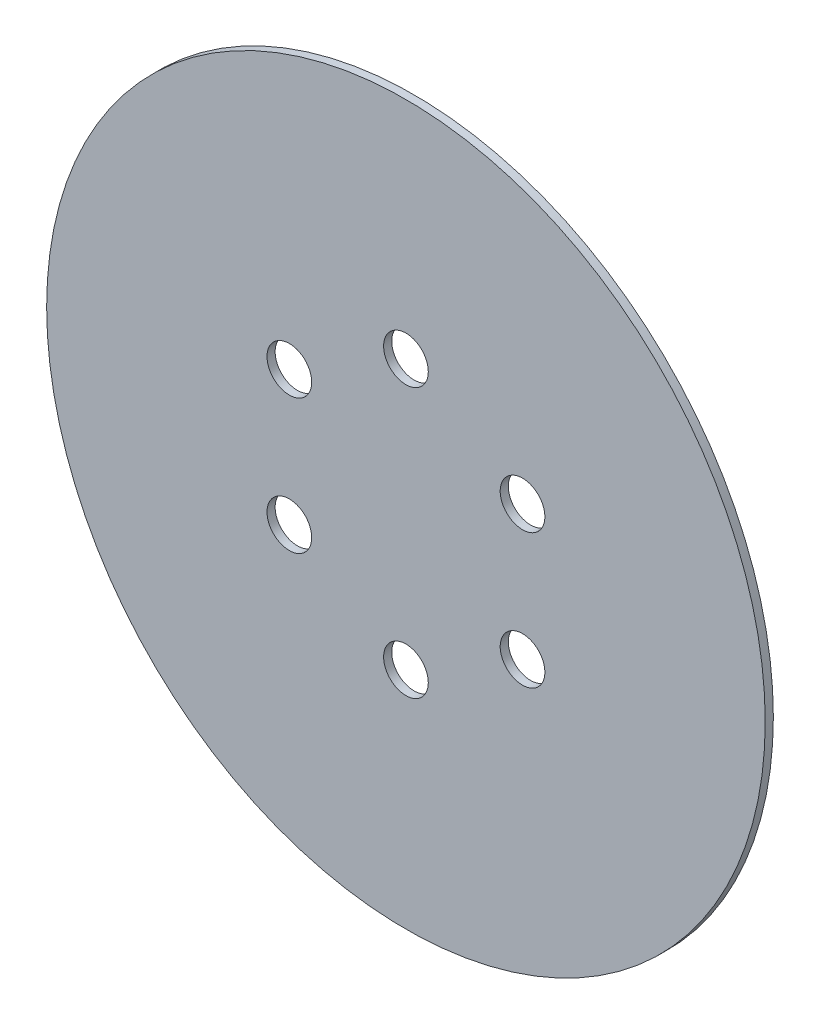
ISO-10303-21;
HEADER;
FILE_DESCRIPTION(('STEP AP214'),'2;1');
FILE_NAME('part.step','',(''),(''),'','','');
FILE_SCHEMA(('AUTOMOTIVE_DESIGN { 1 0 10303 214 1 1 1 1 }'));
ENDSEC;
DATA;
#1=APPLICATION_CONTEXT('core data for automotive mechanical design processes');
#2=APPLICATION_PROTOCOL_DEFINITION('international standard','automotive_design',2000,#1);
#3=PRODUCT_CONTEXT('',#1,'mechanical');
#4=PRODUCT('Part','Part','',(#3));
#5=PRODUCT_RELATED_PRODUCT_CATEGORY('part','',(#4));
#6=PRODUCT_DEFINITION_FORMATION('','',#4);
#7=PRODUCT_DEFINITION_CONTEXT('part definition',#1,'design');
#8=PRODUCT_DEFINITION('design','',#6,#7);
#9=PRODUCT_DEFINITION_SHAPE('','',#8);
#10=(LENGTH_UNIT() NAMED_UNIT(*) SI_UNIT(.MILLI.,.METRE.));
#11=(NAMED_UNIT(*) PLANE_ANGLE_UNIT() SI_UNIT($,.RADIAN.));
#12=(NAMED_UNIT(*) SI_UNIT($,.STERADIAN.) SOLID_ANGLE_UNIT());
#13=UNCERTAINTY_MEASURE_WITH_UNIT(LENGTH_MEASURE(1.E-05),#10,'distance_accuracy_value','');
#14=(GEOMETRIC_REPRESENTATION_CONTEXT(3) GLOBAL_UNCERTAINTY_ASSIGNED_CONTEXT((#13)) GLOBAL_UNIT_ASSIGNED_CONTEXT((#10,
#11,#12)) REPRESENTATION_CONTEXT('',''));
#15=CARTESIAN_POINT('',(0.,0.,0.));
#16=DIRECTION('',(0.,0.,1.));
#17=DIRECTION('',(1.,0.,0.));
#18=AXIS2_PLACEMENT_3D('',#15,#16,#17);
#19=CARTESIAN_POINT('',(0.,1.04933711243064,1.));
#20=DIRECTION('',(0.,0.,1.));
#21=DIRECTION('',(1.,0.,0.));
#22=AXIS2_PLACEMENT_3D('',#19,#20,#21);
#23=PLANE('',#22);
#24=CARTESIAN_POINT('',(-14.3500409407081,-7.23566288756953,1.));
#25=DIRECTION('',(0.,0.,1.));
#26=DIRECTION('',(1.,0.,0.));
#27=AXIS2_PLACEMENT_3D('',#24,#25,#26);
#28=CIRCLE('',#27,2.75);
#29=CARTESIAN_POINT('',(-11.6000409407081,-7.23566288756953,1.));
#30=VERTEX_POINT('',#29);
#31=EDGE_CURVE('E69',#30,#30,#28,.T.);
#32=ORIENTED_EDGE('',*,*,#31,.F.);
#33=EDGE_LOOP('',(#32));
#34=FACE_BOUND('',#33,.T.);
#35=CARTESIAN_POINT('',(14.3500409407082,-7.23566288756933,1.));
#36=DIRECTION('',(0.,0.,1.));
#37=DIRECTION('',(1.,0.,0.));
#38=AXIS2_PLACEMENT_3D('',#35,#36,#37);
#39=CIRCLE('',#38,2.75);
#40=CARTESIAN_POINT('',(17.1000409407082,-7.23566288756933,1.));
#41=VERTEX_POINT('',#40);
#42=EDGE_CURVE('E57',#41,#41,#39,.T.);
#43=ORIENTED_EDGE('',*,*,#42,.F.);
#44=EDGE_LOOP('',(#43));
#45=FACE_BOUND('',#44,.T.);
#46=CARTESIAN_POINT('',(-1.15964705036454E-13,17.6193371124306,1.));
#47=DIRECTION('',(0.,0.,1.));
#48=DIRECTION('',(1.,0.,0.));
#49=AXIS2_PLACEMENT_3D('',#46,#47,#48);
#50=CIRCLE('',#49,2.75);
#51=CARTESIAN_POINT('',(2.74999999999988,17.6193371124306,1.));
#52=VERTEX_POINT('',#51);
#53=EDGE_CURVE('E46',#52,#52,#50,.T.);
#54=ORIENTED_EDGE('',*,*,#53,.F.);
#55=EDGE_LOOP('',(#54));
#56=FACE_BOUND('',#55,.T.);
#57=CARTESIAN_POINT('',(0.,1.04933711243064,1.));
#58=DIRECTION('',(0.,0.,1.));
#59=DIRECTION('',(1.,0.,0.));
#60=AXIS2_PLACEMENT_3D('',#57,#58,#59);
#61=CIRCLE('',#60,44.22);
#62=CARTESIAN_POINT('',(44.22,1.04933711243064,1.));
#63=VERTEX_POINT('',#62);
#64=EDGE_CURVE('E10',#63,#63,#61,.T.);
#65=ORIENTED_EDGE('',*,*,#64,.T.);
#66=EDGE_LOOP('',(#65));
#67=FACE_BOUND('',#66,.T.);
#68=CARTESIAN_POINT('',(14.3500409407081,9.3343371124307,1.));
#69=DIRECTION('',(0.,0.,1.));
#70=DIRECTION('',(1.,0.,0.));
#71=AXIS2_PLACEMENT_3D('',#68,#69,#70);
#72=CIRCLE('',#71,2.75);
#73=CARTESIAN_POINT('',(17.1000409407081,9.3343371124307,1.));
#74=VERTEX_POINT('',#73);
#75=EDGE_CURVE('E51',#74,#74,#72,.T.);
#76=ORIENTED_EDGE('',*,*,#75,.F.);
#77=EDGE_LOOP('',(#76));
#78=FACE_BOUND('',#77,.T.);
#79=CARTESIAN_POINT('',(0.,-15.5206628875694,1.));
#80=DIRECTION('',(0.,0.,1.));
#81=DIRECTION('',(1.,0.,0.));
#82=AXIS2_PLACEMENT_3D('',#79,#80,#81);
#83=CIRCLE('',#82,2.75);
#84=CARTESIAN_POINT('',(2.75,-15.5206628875694,1.));
#85=VERTEX_POINT('',#84);
#86=EDGE_CURVE('E63',#85,#85,#83,.T.);
#87=ORIENTED_EDGE('',*,*,#86,.F.);
#88=EDGE_LOOP('',(#87));
#89=FACE_BOUND('',#88,.T.);
#90=CARTESIAN_POINT('',(-14.3500409407082,9.33433711243051,1.));
#91=DIRECTION('',(0.,0.,1.));
#92=DIRECTION('',(1.,0.,0.));
#93=AXIS2_PLACEMENT_3D('',#90,#91,#92);
#94=CIRCLE('',#93,2.75);
#95=CARTESIAN_POINT('',(-11.6000409407082,9.33433711243051,1.));
#96=VERTEX_POINT('',#95);
#97=EDGE_CURVE('E75',#96,#96,#94,.T.);
#98=ORIENTED_EDGE('',*,*,#97,.F.);
#99=EDGE_LOOP('',(#98));
#100=FACE_BOUND('',#99,.T.);
#101=ADVANCED_FACE('F35',(#34,#45,#56,#67,#78,#89,#100),#23,.T.);
#102=CARTESIAN_POINT('',(0.,1.04933711243064,0.));
#103=DIRECTION('',(0.,0.,1.));
#104=DIRECTION('',(1.,0.,0.));
#105=AXIS2_PLACEMENT_3D('',#102,#103,#104);
#106=PLANE('',#105);
#107=CARTESIAN_POINT('',(0.,1.04933711243064,0.));
#108=DIRECTION('',(0.,0.,1.));
#109=DIRECTION('',(1.,0.,0.));
#110=AXIS2_PLACEMENT_3D('',#107,#108,#109);
#111=CIRCLE('',#110,44.22);
#112=CARTESIAN_POINT('',(44.22,1.04933711243064,0.));
#113=VERTEX_POINT('',#112);
#114=EDGE_CURVE('E39',#113,#113,#111,.T.);
#115=ORIENTED_EDGE('',*,*,#114,.F.);
#116=EDGE_LOOP('',(#115));
#117=FACE_BOUND('',#116,.T.);
#118=CARTESIAN_POINT('',(-1.15964705036454E-13,17.6193371124306,0.));
#119=DIRECTION('',(0.,0.,1.));
#120=DIRECTION('',(1.,0.,0.));
#121=AXIS2_PLACEMENT_3D('',#118,#119,#120);
#122=CIRCLE('',#121,2.75);
#123=CARTESIAN_POINT('',(2.74999999999988,17.6193371124306,0.));
#124=VERTEX_POINT('',#123);
#125=EDGE_CURVE('E48',#124,#124,#122,.T.);
#126=ORIENTED_EDGE('',*,*,#125,.T.);
#127=EDGE_LOOP('',(#126));
#128=FACE_BOUND('',#127,.T.);
#129=CARTESIAN_POINT('',(14.3500409407081,9.3343371124307,0.));
#130=DIRECTION('',(0.,0.,1.));
#131=DIRECTION('',(1.,0.,0.));
#132=AXIS2_PLACEMENT_3D('',#129,#130,#131);
#133=CIRCLE('',#132,2.75);
#134=CARTESIAN_POINT('',(17.1000409407081,9.3343371124307,0.));
#135=VERTEX_POINT('',#134);
#136=EDGE_CURVE('E54',#135,#135,#133,.T.);
#137=ORIENTED_EDGE('',*,*,#136,.T.);
#138=EDGE_LOOP('',(#137));
#139=FACE_BOUND('',#138,.T.);
#140=CARTESIAN_POINT('',(14.3500409407082,-7.23566288756933,0.));
#141=DIRECTION('',(0.,0.,1.));
#142=DIRECTION('',(1.,0.,0.));
#143=AXIS2_PLACEMENT_3D('',#140,#141,#142);
#144=CIRCLE('',#143,2.75);
#145=CARTESIAN_POINT('',(17.1000409407082,-7.23566288756933,0.));
#146=VERTEX_POINT('',#145);
#147=EDGE_CURVE('E60',#146,#146,#144,.T.);
#148=ORIENTED_EDGE('',*,*,#147,.T.);
#149=EDGE_LOOP('',(#148));
#150=FACE_BOUND('',#149,.T.);
#151=CARTESIAN_POINT('',(0.,-15.5206628875694,0.));
#152=DIRECTION('',(0.,0.,1.));
#153=DIRECTION('',(1.,0.,0.));
#154=AXIS2_PLACEMENT_3D('',#151,#152,#153);
#155=CIRCLE('',#154,2.75);
#156=CARTESIAN_POINT('',(2.75,-15.5206628875694,0.));
#157=VERTEX_POINT('',#156);
#158=EDGE_CURVE('E66',#157,#157,#155,.T.);
#159=ORIENTED_EDGE('',*,*,#158,.T.);
#160=EDGE_LOOP('',(#159));
#161=FACE_BOUND('',#160,.T.);
#162=CARTESIAN_POINT('',(-14.3500409407081,-7.23566288756953,0.));
#163=DIRECTION('',(0.,0.,1.));
#164=DIRECTION('',(1.,0.,0.));
#165=AXIS2_PLACEMENT_3D('',#162,#163,#164);
#166=CIRCLE('',#165,2.75);
#167=CARTESIAN_POINT('',(-11.6000409407081,-7.23566288756953,0.));
#168=VERTEX_POINT('',#167);
#169=EDGE_CURVE('E72',#168,#168,#166,.T.);
#170=ORIENTED_EDGE('',*,*,#169,.T.);
#171=EDGE_LOOP('',(#170));
#172=FACE_BOUND('',#171,.T.);
#173=CARTESIAN_POINT('',(-14.3500409407082,9.33433711243051,0.));
#174=DIRECTION('',(0.,0.,1.));
#175=DIRECTION('',(1.,0.,0.));
#176=AXIS2_PLACEMENT_3D('',#173,#174,#175);
#177=CIRCLE('',#176,2.75);
#178=CARTESIAN_POINT('',(-11.6000409407082,9.33433711243051,0.));
#179=VERTEX_POINT('',#178);
#180=EDGE_CURVE('E78',#179,#179,#177,.T.);
#181=ORIENTED_EDGE('',*,*,#180,.T.);
#182=EDGE_LOOP('',(#181));
#183=FACE_BOUND('',#182,.T.);
#184=ADVANCED_FACE('F88',(#117,#128,#139,#150,#161,#172,#183),#106,.F.);
#185=CARTESIAN_POINT('',(0.,1.04933711243064,1.));
#186=DIRECTION('',(0.,0.,-1.));
#187=DIRECTION('',(-1.,0.,0.));
#188=AXIS2_PLACEMENT_3D('',#185,#186,#187);
#189=CYLINDRICAL_SURFACE('',#188,44.22);
#190=ORIENTED_EDGE('',*,*,#64,.F.);
#191=EDGE_LOOP('',(#190));
#192=FACE_BOUND('',#191,.T.);
#193=ORIENTED_EDGE('',*,*,#114,.T.);
#194=EDGE_LOOP('',(#193));
#195=FACE_BOUND('',#194,.T.);
#196=ADVANCED_FACE('F37',(#192,#195),#189,.T.);
#197=CARTESIAN_POINT('',(-1.15964705036454E-13,17.6193371124306,1.));
#198=DIRECTION('',(0.,0.,-1.));
#199=DIRECTION('',(-1.,0.,0.));
#200=AXIS2_PLACEMENT_3D('',#197,#198,#199);
#201=CYLINDRICAL_SURFACE('',#200,2.75);
#202=ORIENTED_EDGE('',*,*,#53,.T.);
#203=EDGE_LOOP('',(#202));
#204=FACE_BOUND('',#203,.T.);
#205=ORIENTED_EDGE('',*,*,#125,.F.);
#206=EDGE_LOOP('',(#205));
#207=FACE_BOUND('',#206,.T.);
#208=ADVANCED_FACE('F98',(#204,#207),#201,.F.);
#209=CARTESIAN_POINT('',(14.3500409407081,9.3343371124307,1.));
#210=DIRECTION('',(0.,0.,-1.));
#211=DIRECTION('',(-1.,0.,0.));
#212=AXIS2_PLACEMENT_3D('',#209,#210,#211);
#213=CYLINDRICAL_SURFACE('',#212,2.75);
#214=ORIENTED_EDGE('',*,*,#75,.T.);
#215=EDGE_LOOP('',(#214));
#216=FACE_BOUND('',#215,.T.);
#217=ORIENTED_EDGE('',*,*,#136,.F.);
#218=EDGE_LOOP('',(#217));
#219=FACE_BOUND('',#218,.T.);
#220=ADVANCED_FACE('F101',(#216,#219),#213,.F.);
#221=CARTESIAN_POINT('',(14.3500409407082,-7.23566288756933,1.));
#222=DIRECTION('',(0.,0.,-1.));
#223=DIRECTION('',(-1.,0.,0.));
#224=AXIS2_PLACEMENT_3D('',#221,#222,#223);
#225=CYLINDRICAL_SURFACE('',#224,2.75);
#226=ORIENTED_EDGE('',*,*,#42,.T.);
#227=EDGE_LOOP('',(#226));
#228=FACE_BOUND('',#227,.T.);
#229=ORIENTED_EDGE('',*,*,#147,.F.);
#230=EDGE_LOOP('',(#229));
#231=FACE_BOUND('',#230,.T.);
#232=ADVANCED_FACE('F105',(#228,#231),#225,.F.);
#233=CARTESIAN_POINT('',(0.,-15.5206628875694,1.));
#234=DIRECTION('',(0.,0.,-1.));
#235=DIRECTION('',(-1.,0.,0.));
#236=AXIS2_PLACEMENT_3D('',#233,#234,#235);
#237=CYLINDRICAL_SURFACE('',#236,2.75);
#238=ORIENTED_EDGE('',*,*,#86,.T.);
#239=EDGE_LOOP('',(#238));
#240=FACE_BOUND('',#239,.T.);
#241=ORIENTED_EDGE('',*,*,#158,.F.);
#242=EDGE_LOOP('',(#241));
#243=FACE_BOUND('',#242,.T.);
#244=ADVANCED_FACE('F109',(#240,#243),#237,.F.);
#245=CARTESIAN_POINT('',(-14.3500409407081,-7.23566288756953,1.));
#246=DIRECTION('',(0.,0.,-1.));
#247=DIRECTION('',(-1.,0.,0.));
#248=AXIS2_PLACEMENT_3D('',#245,#246,#247);
#249=CYLINDRICAL_SURFACE('',#248,2.75);
#250=ORIENTED_EDGE('',*,*,#31,.T.);
#251=EDGE_LOOP('',(#250));
#252=FACE_BOUND('',#251,.T.);
#253=ORIENTED_EDGE('',*,*,#169,.F.);
#254=EDGE_LOOP('',(#253));
#255=FACE_BOUND('',#254,.T.);
#256=ADVANCED_FACE('F113',(#252,#255),#249,.F.);
#257=CARTESIAN_POINT('',(-14.3500409407082,9.33433711243051,1.));
#258=DIRECTION('',(0.,0.,-1.));
#259=DIRECTION('',(-1.,0.,0.));
#260=AXIS2_PLACEMENT_3D('',#257,#258,#259);
#261=CYLINDRICAL_SURFACE('',#260,2.75);
#262=ORIENTED_EDGE('',*,*,#97,.T.);
#263=EDGE_LOOP('',(#262));
#264=FACE_BOUND('',#263,.T.);
#265=ORIENTED_EDGE('',*,*,#180,.F.);
#266=EDGE_LOOP('',(#265));
#267=FACE_BOUND('',#266,.T.);
#268=ADVANCED_FACE('F84',(#264,#267),#261,.F.);
#269=CLOSED_SHELL('',(#101,#184,#196,#208,#220,#232,#244,#256,#268));
#270=MANIFOLD_SOLID_BREP('B2',#269);
#271=ADVANCED_BREP_SHAPE_REPRESENTATION('',(#18,#270),#14);
#272=SHAPE_DEFINITION_REPRESENTATION(#9,#271);
ENDSEC;
END-ISO-10303-21;
